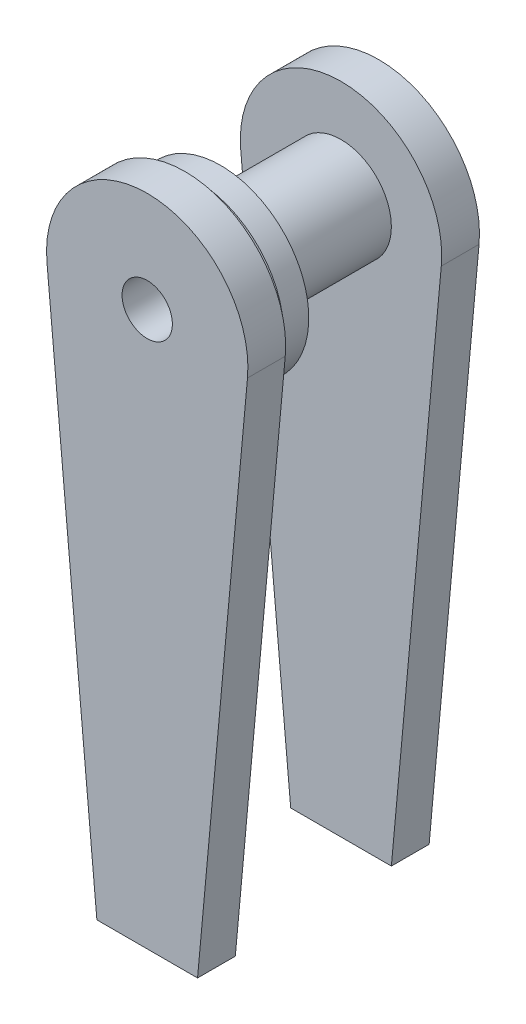
ISO-10303-21;
HEADER;
FILE_DESCRIPTION(('STEP AP214'),'2;1');
FILE_NAME('part.step','',(''),(''),'','','');
FILE_SCHEMA(('AUTOMOTIVE_DESIGN { 1 0 10303 214 1 1 1 1 }'));
ENDSEC;
DATA;
#1=APPLICATION_CONTEXT('core data for automotive mechanical design processes');
#2=APPLICATION_PROTOCOL_DEFINITION('international standard','automotive_design',2000,#1);
#3=PRODUCT_CONTEXT('',#1,'mechanical');
#4=PRODUCT('Part','Part','',(#3));
#5=PRODUCT_RELATED_PRODUCT_CATEGORY('part','',(#4));
#6=PRODUCT_DEFINITION_FORMATION('','',#4);
#7=PRODUCT_DEFINITION_CONTEXT('part definition',#1,'design');
#8=PRODUCT_DEFINITION('design','',#6,#7);
#9=PRODUCT_DEFINITION_SHAPE('','',#8);
#10=(LENGTH_UNIT() NAMED_UNIT(*) SI_UNIT(.MILLI.,.METRE.));
#11=(NAMED_UNIT(*) PLANE_ANGLE_UNIT() SI_UNIT($,.RADIAN.));
#12=(NAMED_UNIT(*) SI_UNIT($,.STERADIAN.) SOLID_ANGLE_UNIT());
#13=UNCERTAINTY_MEASURE_WITH_UNIT(LENGTH_MEASURE(1.E-05),#10,'distance_accuracy_value','');
#14=(GEOMETRIC_REPRESENTATION_CONTEXT(3) GLOBAL_UNCERTAINTY_ASSIGNED_CONTEXT((#13)) GLOBAL_UNIT_ASSIGNED_CONTEXT((#10,
#11,#12)) REPRESENTATION_CONTEXT('',''));
#15=CARTESIAN_POINT('',(0.,0.,0.));
#16=DIRECTION('',(0.,0.,1.));
#17=DIRECTION('',(1.,0.,0.));
#18=AXIS2_PLACEMENT_3D('',#15,#16,#17);
#19=CARTESIAN_POINT('',(0.,0.,48.895));
#20=DIRECTION('',(0.,0.,-1.));
#21=DIRECTION('',(-1.,0.,0.));
#22=AXIS2_PLACEMENT_3D('',#19,#20,#21);
#23=CYLINDRICAL_SURFACE('',#22,12.7);
#24=CARTESIAN_POINT('',(0.,0.,48.895));
#25=DIRECTION('',(0.,0.,1.));
#26=DIRECTION('',(1.,0.,0.));
#27=AXIS2_PLACEMENT_3D('',#24,#25,#26);
#28=CIRCLE('',#27,12.7);
#29=CARTESIAN_POINT('',(12.7,0.,48.895));
#30=VERTEX_POINT('',#29);
#31=EDGE_CURVE('E175',#30,#30,#28,.T.);
#32=ORIENTED_EDGE('',*,*,#31,.F.);
#33=EDGE_LOOP('',(#32));
#34=FACE_BOUND('',#33,.T.);
#35=CARTESIAN_POINT('',(0.,0.,46.228));
#36=DIRECTION('',(0.,0.,-1.));
#37=DIRECTION('',(-1.,0.,0.));
#38=AXIS2_PLACEMENT_3D('',#35,#36,#37);
#39=CIRCLE('',#38,12.7);
#40=CARTESIAN_POINT('',(-12.7,0.,46.228));
#41=VERTEX_POINT('',#40);
#42=EDGE_CURVE('E11',#41,#41,#39,.T.);
#43=ORIENTED_EDGE('',*,*,#42,.F.);
#44=EDGE_LOOP('',(#43));
#45=FACE_BOUND('',#44,.T.);
#46=ADVANCED_FACE('F39',(#34,#45),#23,.T.);
#47=CARTESIAN_POINT('',(0.,0.,9.525));
#48=DIRECTION('',(0.,0.,1.));
#49=DIRECTION('',(1.,0.,0.));
#50=AXIS2_PLACEMENT_3D('',#47,#48,#49);
#51=PLANE('',#50);
#52=DIRECTION('',(-0.0912886844983583,-0.995824470518052,0.));
#53=VECTOR('',#52,1.);
#54=CARTESIAN_POINT('',(25.2939415511585,-2.3187325862583,9.525));
#55=LINE('',#54,#53);
#56=CARTESIAN_POINT('',(25.2939415511585,-2.3187325862583,9.525));
#57=VERTEX_POINT('',#56);
#58=CARTESIAN_POINT('',(12.7000000000001,-139.7,9.525));
#59=VERTEX_POINT('',#58);
#60=EDGE_CURVE('E183',#57,#59,#55,.T.);
#61=ORIENTED_EDGE('',*,*,#60,.F.);
#62=CARTESIAN_POINT('',(0.,0.,9.525));
#63=DIRECTION('',(0.,0.,1.));
#64=DIRECTION('',(1.,0.,0.));
#65=AXIS2_PLACEMENT_3D('',#62,#63,#64);
#66=CIRCLE('',#65,25.4);
#67=CARTESIAN_POINT('',(-25.2939415511585,-2.31873258625833,9.525));
#68=VERTEX_POINT('',#67);
#69=EDGE_CURVE('E186',#57,#68,#66,.T.);
#70=ORIENTED_EDGE('',*,*,#69,.T.);
#71=DIRECTION('',(0.0912886844983595,-0.995824470518052,0.));
#72=VECTOR('',#71,1.);
#73=CARTESIAN_POINT('',(-25.2939415511585,-2.31873258625833,9.525));
#74=LINE('',#73,#72);
#75=CARTESIAN_POINT('',(-12.6999999999999,-139.7,9.525));
#76=VERTEX_POINT('',#75);
#77=EDGE_CURVE('E190',#68,#76,#74,.T.);
#78=ORIENTED_EDGE('',*,*,#77,.T.);
#79=DIRECTION('',(1.,0.,0.));
#80=VECTOR('',#79,1.);
#81=CARTESIAN_POINT('',(0.,-139.7,9.525));
#82=LINE('',#81,#80);
#83=EDGE_CURVE('E57',#76,#59,#82,.T.);
#84=ORIENTED_EDGE('',*,*,#83,.T.);
#85=EDGE_LOOP('',(#61,#70,#78,#84));
#86=FACE_BOUND('',#85,.T.);
#87=CARTESIAN_POINT('',(0.,0.,9.525));
#88=DIRECTION('',(0.,0.,1.));
#89=DIRECTION('',(1.,0.,0.));
#90=AXIS2_PLACEMENT_3D('',#87,#88,#89);
#91=CIRCLE('',#90,12.7);
#92=CARTESIAN_POINT('',(12.7,0.,9.525));
#93=VERTEX_POINT('',#92);
#94=EDGE_CURVE('E137',#93,#93,#91,.T.);
#95=ORIENTED_EDGE('',*,*,#94,.F.);
#96=EDGE_LOOP('',(#95));
#97=FACE_BOUND('',#96,.T.);
#98=ADVANCED_FACE('F226',(#86,#97),#51,.T.);
#99=CARTESIAN_POINT('',(25.2939415511585,-2.3187325862583,9.525));
#100=DIRECTION('',(0.995824470518052,-0.0912886844983583,0.));
#101=DIRECTION('',(0.0912886844983583,0.995824470518052,0.));
#102=AXIS2_PLACEMENT_3D('',#99,#100,#101);
#103=PLANE('',#102);
#104=DIRECTION('',(-0.0912886844983583,-0.995824470518052,0.));
#105=VECTOR('',#104,1.);
#106=CARTESIAN_POINT('',(25.2939415511585,-2.3187325862583,0.));
#107=LINE('',#106,#105);
#108=CARTESIAN_POINT('',(25.2939415511585,-2.3187325862583,0.));
#109=VERTEX_POINT('',#108);
#110=CARTESIAN_POINT('',(12.7000000000001,-139.7,0.));
#111=VERTEX_POINT('',#110);
#112=EDGE_CURVE('E179',#109,#111,#107,.T.);
#113=ORIENTED_EDGE('',*,*,#112,.F.);
#114=DIRECTION('',(0.,0.,-1.));
#115=VECTOR('',#114,1.);
#116=CARTESIAN_POINT('',(25.2939415511585,-2.3187325862583,9.525));
#117=LINE('',#116,#115);
#118=EDGE_CURVE('E49',#57,#109,#117,.T.);
#119=ORIENTED_EDGE('',*,*,#118,.F.);
#120=ORIENTED_EDGE('',*,*,#60,.T.);
#121=DIRECTION('',(0.,0.,-1.));
#122=VECTOR('',#121,1.);
#123=CARTESIAN_POINT('',(12.7000000000001,-139.7,9.525));
#124=LINE('',#123,#122);
#125=EDGE_CURVE('E82',#59,#111,#124,.T.);
#126=ORIENTED_EDGE('',*,*,#125,.T.);
#127=EDGE_LOOP('',(#113,#119,#120,#126));
#128=FACE_BOUND('',#127,.T.);
#129=ADVANCED_FACE('F41',(#128),#103,.T.);
#130=CARTESIAN_POINT('',(0.,0.,9.525));
#131=DIRECTION('',(0.,0.,-1.));
#132=DIRECTION('',(-1.,0.,0.));
#133=AXIS2_PLACEMENT_3D('',#130,#131,#132);
#134=CYLINDRICAL_SURFACE('',#133,25.4);
#135=CARTESIAN_POINT('',(0.,0.,0.));
#136=DIRECTION('',(0.,0.,1.));
#137=DIRECTION('',(1.,0.,0.));
#138=AXIS2_PLACEMENT_3D('',#135,#136,#137);
#139=CIRCLE('',#138,25.4);
#140=CARTESIAN_POINT('',(-25.2939415511585,-2.31873258625833,0.));
#141=VERTEX_POINT('',#140);
#142=EDGE_CURVE('E198',#109,#141,#139,.T.);
#143=ORIENTED_EDGE('',*,*,#142,.T.);
#144=DIRECTION('',(0.,0.,-1.));
#145=VECTOR('',#144,1.);
#146=CARTESIAN_POINT('',(-25.2939415511585,-2.31873258625833,9.525));
#147=LINE('',#146,#145);
#148=EDGE_CURVE('E214',#68,#141,#147,.T.);
#149=ORIENTED_EDGE('',*,*,#148,.F.);
#150=ORIENTED_EDGE('',*,*,#69,.F.);
#151=ORIENTED_EDGE('',*,*,#118,.T.);
#152=EDGE_LOOP('',(#143,#149,#150,#151));
#153=FACE_BOUND('',#152,.T.);
#154=ADVANCED_FACE('F219',(#153),#134,.T.);
#155=CARTESIAN_POINT('',(-25.2939415511585,-2.31873258625833,9.525));
#156=DIRECTION('',(0.995824470518052,0.0912886844983595,0.));
#157=DIRECTION('',(-0.0912886844983595,0.995824470518052,0.));
#158=AXIS2_PLACEMENT_3D('',#155,#156,#157);
#159=PLANE('',#158);
#160=DIRECTION('',(0.0912886844983595,-0.995824470518052,0.));
#161=VECTOR('',#160,1.);
#162=CARTESIAN_POINT('',(-25.2939415511585,-2.31873258625833,0.));
#163=LINE('',#162,#161);
#164=CARTESIAN_POINT('',(-12.6999999999999,-139.7,0.));
#165=VERTEX_POINT('',#164);
#166=EDGE_CURVE('E75',#141,#165,#163,.T.);
#167=ORIENTED_EDGE('',*,*,#166,.T.);
#168=DIRECTION('',(0.,0.,-1.));
#169=VECTOR('',#168,1.);
#170=CARTESIAN_POINT('',(-12.6999999999999,-139.7,9.525));
#171=LINE('',#170,#169);
#172=EDGE_CURVE('E211',#76,#165,#171,.T.);
#173=ORIENTED_EDGE('',*,*,#172,.F.);
#174=ORIENTED_EDGE('',*,*,#77,.F.);
#175=ORIENTED_EDGE('',*,*,#148,.T.);
#176=EDGE_LOOP('',(#167,#173,#174,#175));
#177=FACE_BOUND('',#176,.T.);
#178=ADVANCED_FACE('F231',(#177),#159,.F.);
#179=CARTESIAN_POINT('',(0.,-139.7,9.525));
#180=DIRECTION('',(0.,1.,0.));
#181=DIRECTION('',(0.,0.,1.));
#182=AXIS2_PLACEMENT_3D('',#179,#180,#181);
#183=PLANE('',#182);
#184=DIRECTION('',(1.,0.,0.));
#185=VECTOR('',#184,1.);
#186=CARTESIAN_POINT('',(0.,-139.7,0.));
#187=LINE('',#186,#185);
#188=EDGE_CURVE('E203',#165,#111,#187,.T.);
#189=ORIENTED_EDGE('',*,*,#188,.T.);
#190=ORIENTED_EDGE('',*,*,#125,.F.);
#191=ORIENTED_EDGE('',*,*,#83,.F.);
#192=ORIENTED_EDGE('',*,*,#172,.T.);
#193=EDGE_LOOP('',(#189,#190,#191,#192));
#194=FACE_BOUND('',#193,.T.);
#195=ADVANCED_FACE('F370',(#194),#183,.F.);
#196=CARTESIAN_POINT('',(0.,0.,9.525));
#197=DIRECTION('',(0.,0.,-1.));
#198=DIRECTION('',(-1.,0.,0.));
#199=AXIS2_PLACEMENT_3D('',#196,#197,#198);
#200=CYLINDRICAL_SURFACE('',#199,6.35);
#201=CARTESIAN_POINT('',(0.,0.,0.));
#202=DIRECTION('',(0.,0.,1.));
#203=DIRECTION('',(1.,0.,0.));
#204=AXIS2_PLACEMENT_3D('',#201,#202,#203);
#205=CIRCLE('',#204,6.35);
#206=CARTESIAN_POINT('',(6.35,0.,0.));
#207=VERTEX_POINT('',#206);
#208=EDGE_CURVE('E187',#207,#207,#205,.T.);
#209=ORIENTED_EDGE('',*,*,#208,.F.);
#210=EDGE_LOOP('',(#209));
#211=FACE_BOUND('',#210,.T.);
#212=CARTESIAN_POINT('',(0.,0.,58.42));
#213=DIRECTION('',(0.,0.,1.));
#214=DIRECTION('',(1.,0.,0.));
#215=AXIS2_PLACEMENT_3D('',#212,#213,#214);
#216=CIRCLE('',#215,6.35);
#217=CARTESIAN_POINT('',(6.35,0.,58.42));
#218=VERTEX_POINT('',#217);
#219=EDGE_CURVE('E126',#218,#218,#216,.T.);
#220=ORIENTED_EDGE('',*,*,#219,.T.);
#221=EDGE_LOOP('',(#220));
#222=FACE_BOUND('',#221,.T.);
#223=ADVANCED_FACE('F248',(#211,#222),#200,.F.);
#224=CARTESIAN_POINT('',(0.,0.,0.));
#225=DIRECTION('',(0.,0.,1.));
#226=DIRECTION('',(1.,0.,0.));
#227=AXIS2_PLACEMENT_3D('',#224,#225,#226);
#228=PLANE('',#227);
#229=ORIENTED_EDGE('',*,*,#112,.T.);
#230=ORIENTED_EDGE('',*,*,#188,.F.);
#231=ORIENTED_EDGE('',*,*,#166,.F.);
#232=ORIENTED_EDGE('',*,*,#142,.F.);
#233=EDGE_LOOP('',(#229,#230,#231,#232));
#234=FACE_BOUND('',#233,.T.);
#235=ORIENTED_EDGE('',*,*,#208,.T.);
#236=EDGE_LOOP('',(#235));
#237=FACE_BOUND('',#236,.T.);
#238=ADVANCED_FACE('F222',(#234,#237),#228,.F.);
#239=CARTESIAN_POINT('',(0.,0.,39.878));
#240=DIRECTION('',(0.,0.,-1.));
#241=DIRECTION('',(-1.,0.,0.));
#242=AXIS2_PLACEMENT_3D('',#239,#240,#241);
#243=CIRCLE('',#242,12.7);
#244=CARTESIAN_POINT('',(-12.7,0.,39.878));
#245=VERTEX_POINT('',#244);
#246=EDGE_CURVE('E253',#245,#245,#243,.T.);
#247=ORIENTED_EDGE('',*,*,#246,.T.);
#248=EDGE_LOOP('',(#247));
#249=FACE_BOUND('',#248,.T.);
#250=ORIENTED_EDGE('',*,*,#94,.T.);
#251=EDGE_LOOP('',(#250));
#252=FACE_BOUND('',#251,.T.);
#253=ADVANCED_FACE('F236',(#249,#252),#23,.T.);
#254=CARTESIAN_POINT('',(25.2939415511585,-2.3187325862583,48.895));
#255=DIRECTION('',(-0.995824470518052,0.0912886844983583,0.));
#256=DIRECTION('',(-0.0912886844983583,-0.995824470518052,0.));
#257=AXIS2_PLACEMENT_3D('',#254,#255,#256);
#258=PLANE('',#257);
#259=DIRECTION('',(-0.0912886844983583,-0.995824470518052,0.));
#260=VECTOR('',#259,1.);
#261=CARTESIAN_POINT('',(25.2939415511585,-2.3187325862583,58.42));
#262=LINE('',#261,#260);
#263=CARTESIAN_POINT('',(25.2939415511585,-2.3187325862583,58.42));
#264=VERTEX_POINT('',#263);
#265=CARTESIAN_POINT('',(12.7000000000001,-139.7,58.42));
#266=VERTEX_POINT('',#265);
#267=EDGE_CURVE('E132',#264,#266,#262,.T.);
#268=ORIENTED_EDGE('',*,*,#267,.T.);
#269=DIRECTION('',(0.,0.,1.));
#270=VECTOR('',#269,1.);
#271=CARTESIAN_POINT('',(12.7000000000001,-139.7,48.895));
#272=LINE('',#271,#270);
#273=CARTESIAN_POINT('',(12.7000000000001,-139.7,48.895));
#274=VERTEX_POINT('',#273);
#275=EDGE_CURVE('E129',#274,#266,#272,.T.);
#276=ORIENTED_EDGE('',*,*,#275,.F.);
#277=DIRECTION('',(-0.0912886844983583,-0.995824470518052,0.));
#278=VECTOR('',#277,1.);
#279=CARTESIAN_POINT('',(25.2939415511585,-2.3187325862583,48.895));
#280=LINE('',#279,#278);
#281=CARTESIAN_POINT('',(25.2939415511585,-2.3187325862583,48.895));
#282=VERTEX_POINT('',#281);
#283=EDGE_CURVE('E115',#282,#274,#280,.T.);
#284=ORIENTED_EDGE('',*,*,#283,.F.);
#285=DIRECTION('',(0.,0.,1.));
#286=VECTOR('',#285,1.);
#287=CARTESIAN_POINT('',(25.2939415511585,-2.3187325862583,48.895));
#288=LINE('',#287,#286);
#289=EDGE_CURVE('E150',#282,#264,#288,.T.);
#290=ORIENTED_EDGE('',*,*,#289,.T.);
#291=EDGE_LOOP('',(#268,#276,#284,#290));
#292=FACE_BOUND('',#291,.T.);
#293=ADVANCED_FACE('F130',(#292),#258,.F.);
#294=CARTESIAN_POINT('',(0.,-139.7,48.895));
#295=DIRECTION('',(0.,-1.,0.));
#296=DIRECTION('',(0.,0.,-1.));
#297=AXIS2_PLACEMENT_3D('',#294,#295,#296);
#298=PLANE('',#297);
#299=DIRECTION('',(1.,0.,0.));
#300=VECTOR('',#299,1.);
#301=CARTESIAN_POINT('',(0.,-139.7,58.42));
#302=LINE('',#301,#300);
#303=CARTESIAN_POINT('',(-12.6999999999999,-139.7,58.42));
#304=VERTEX_POINT('',#303);
#305=EDGE_CURVE('E153',#304,#266,#302,.T.);
#306=ORIENTED_EDGE('',*,*,#305,.F.);
#307=DIRECTION('',(0.,0.,1.));
#308=VECTOR('',#307,1.);
#309=CARTESIAN_POINT('',(-12.6999999999999,-139.7,48.895));
#310=LINE('',#309,#308);
#311=CARTESIAN_POINT('',(-12.6999999999999,-139.7,48.895));
#312=VERTEX_POINT('',#311);
#313=EDGE_CURVE('E138',#312,#304,#310,.T.);
#314=ORIENTED_EDGE('',*,*,#313,.F.);
#315=DIRECTION('',(1.,0.,0.));
#316=VECTOR('',#315,1.);
#317=CARTESIAN_POINT('',(0.,-139.7,48.895));
#318=LINE('',#317,#316);
#319=EDGE_CURVE('E120',#312,#274,#318,.T.);
#320=ORIENTED_EDGE('',*,*,#319,.T.);
#321=ORIENTED_EDGE('',*,*,#275,.T.);
#322=EDGE_LOOP('',(#306,#314,#320,#321));
#323=FACE_BOUND('',#322,.T.);
#324=ADVANCED_FACE('F140',(#323),#298,.T.);
#325=CARTESIAN_POINT('',(-25.2939415511585,-2.31873258625833,48.895));
#326=DIRECTION('',(-0.995824470518052,-0.0912886844983595,0.));
#327=DIRECTION('',(0.0912886844983595,-0.995824470518052,0.));
#328=AXIS2_PLACEMENT_3D('',#325,#326,#327);
#329=PLANE('',#328);
#330=DIRECTION('',(0.0912886844983595,-0.995824470518052,0.));
#331=VECTOR('',#330,1.);
#332=CARTESIAN_POINT('',(-25.2939415511585,-2.31873258625833,58.42));
#333=LINE('',#332,#331);
#334=CARTESIAN_POINT('',(-25.2939415511585,-2.31873258625833,58.42));
#335=VERTEX_POINT('',#334);
#336=EDGE_CURVE('E157',#335,#304,#333,.T.);
#337=ORIENTED_EDGE('',*,*,#336,.F.);
#338=DIRECTION('',(0.,0.,1.));
#339=VECTOR('',#338,1.);
#340=CARTESIAN_POINT('',(-25.2939415511585,-2.31873258625833,48.895));
#341=LINE('',#340,#339);
#342=CARTESIAN_POINT('',(-25.2939415511585,-2.31873258625833,48.895));
#343=VERTEX_POINT('',#342);
#344=EDGE_CURVE('E170',#343,#335,#341,.T.);
#345=ORIENTED_EDGE('',*,*,#344,.F.);
#346=DIRECTION('',(0.0912886844983595,-0.995824470518052,0.));
#347=VECTOR('',#346,1.);
#348=CARTESIAN_POINT('',(-25.2939415511585,-2.31873258625833,48.895));
#349=LINE('',#348,#347);
#350=EDGE_CURVE('E142',#343,#312,#349,.T.);
#351=ORIENTED_EDGE('',*,*,#350,.T.);
#352=ORIENTED_EDGE('',*,*,#313,.T.);
#353=EDGE_LOOP('',(#337,#345,#351,#352));
#354=FACE_BOUND('',#353,.T.);
#355=ADVANCED_FACE('F292',(#354),#329,.T.);
#356=CARTESIAN_POINT('',(0.,0.,48.895));
#357=DIRECTION('',(0.,0.,1.));
#358=DIRECTION('',(1.,0.,0.));
#359=AXIS2_PLACEMENT_3D('',#356,#357,#358);
#360=CYLINDRICAL_SURFACE('',#359,25.4);
#361=CARTESIAN_POINT('',(0.,0.,58.42));
#362=DIRECTION('',(0.,0.,1.));
#363=DIRECTION('',(1.,0.,0.));
#364=AXIS2_PLACEMENT_3D('',#361,#362,#363);
#365=CIRCLE('',#364,25.4);
#366=EDGE_CURVE('E161',#264,#335,#365,.T.);
#367=ORIENTED_EDGE('',*,*,#366,.F.);
#368=ORIENTED_EDGE('',*,*,#289,.F.);
#369=CARTESIAN_POINT('',(0.,0.,48.895));
#370=DIRECTION('',(0.,0.,1.));
#371=DIRECTION('',(1.,0.,0.));
#372=AXIS2_PLACEMENT_3D('',#369,#370,#371);
#373=CIRCLE('',#372,25.4);
#374=EDGE_CURVE('E123',#282,#343,#373,.T.);
#375=ORIENTED_EDGE('',*,*,#374,.T.);
#376=ORIENTED_EDGE('',*,*,#344,.T.);
#377=EDGE_LOOP('',(#367,#368,#375,#376));
#378=FACE_BOUND('',#377,.T.);
#379=ADVANCED_FACE('F285',(#378),#360,.T.);
#380=CARTESIAN_POINT('',(0.,0.,48.895));
#381=DIRECTION('',(0.,0.,-1.));
#382=DIRECTION('',(1.,0.,0.));
#383=AXIS2_PLACEMENT_3D('',#380,#381,#382);
#384=PLANE('',#383);
#385=ORIENTED_EDGE('',*,*,#31,.T.);
#386=EDGE_LOOP('',(#385));
#387=FACE_BOUND('',#386,.T.);
#388=ORIENTED_EDGE('',*,*,#283,.T.);
#389=ORIENTED_EDGE('',*,*,#319,.F.);
#390=ORIENTED_EDGE('',*,*,#350,.F.);
#391=ORIENTED_EDGE('',*,*,#374,.F.);
#392=EDGE_LOOP('',(#388,#389,#390,#391));
#393=FACE_BOUND('',#392,.T.);
#394=ADVANCED_FACE('F117',(#387,#393),#384,.T.);
#395=CARTESIAN_POINT('',(0.,0.,58.42));
#396=DIRECTION('',(0.,0.,-1.));
#397=DIRECTION('',(1.,0.,0.));
#398=AXIS2_PLACEMENT_3D('',#395,#396,#397);
#399=PLANE('',#398);
#400=ORIENTED_EDGE('',*,*,#267,.F.);
#401=ORIENTED_EDGE('',*,*,#366,.T.);
#402=ORIENTED_EDGE('',*,*,#336,.T.);
#403=ORIENTED_EDGE('',*,*,#305,.T.);
#404=EDGE_LOOP('',(#400,#401,#402,#403));
#405=FACE_BOUND('',#404,.T.);
#406=ORIENTED_EDGE('',*,*,#219,.F.);
#407=EDGE_LOOP('',(#406));
#408=FACE_BOUND('',#407,.T.);
#409=ADVANCED_FACE('F280',(#405,#408),#399,.F.);
#410=CARTESIAN_POINT('',(0.,0.,46.228));
#411=DIRECTION('',(0.,0.,-1.));
#412=DIRECTION('',(-1.,0.,0.));
#413=AXIS2_PLACEMENT_3D('',#410,#411,#412);
#414=CYLINDRICAL_SURFACE('',#413,22.225);
#415=CARTESIAN_POINT('',(0.,0.,46.228));
#416=DIRECTION('',(0.,0.,-1.));
#417=DIRECTION('',(-1.,0.,0.));
#418=AXIS2_PLACEMENT_3D('',#415,#416,#417);
#419=CIRCLE('',#418,22.225);
#420=CARTESIAN_POINT('',(-22.225,0.,46.228));
#421=VERTEX_POINT('',#420);
#422=EDGE_CURVE('E154',#421,#421,#419,.T.);
#423=ORIENTED_EDGE('',*,*,#422,.T.);
#424=EDGE_LOOP('',(#423));
#425=FACE_BOUND('',#424,.T.);
#426=CARTESIAN_POINT('',(0.,0.,39.878));
#427=DIRECTION('',(0.,0.,-1.));
#428=DIRECTION('',(-1.,0.,0.));
#429=AXIS2_PLACEMENT_3D('',#426,#427,#428);
#430=CIRCLE('',#429,22.225);
#431=CARTESIAN_POINT('',(-22.225,0.,39.878));
#432=VERTEX_POINT('',#431);
#433=EDGE_CURVE('E258',#432,#432,#430,.T.);
#434=ORIENTED_EDGE('',*,*,#433,.F.);
#435=EDGE_LOOP('',(#434));
#436=FACE_BOUND('',#435,.T.);
#437=ADVANCED_FACE('F267',(#425,#436),#414,.T.);
#438=CARTESIAN_POINT('',(0.,0.,46.228));
#439=DIRECTION('',(0.,0.,-1.));
#440=DIRECTION('',(-1.,0.,0.));
#441=AXIS2_PLACEMENT_3D('',#438,#439,#440);
#442=PLANE('',#441);
#443=ORIENTED_EDGE('',*,*,#42,.T.);
#444=EDGE_LOOP('',(#443));
#445=FACE_BOUND('',#444,.T.);
#446=ORIENTED_EDGE('',*,*,#422,.F.);
#447=EDGE_LOOP('',(#446));
#448=FACE_BOUND('',#447,.T.);
#449=ADVANCED_FACE('F270',(#445,#448),#442,.F.);
#450=CARTESIAN_POINT('',(0.,0.,39.878));
#451=DIRECTION('',(0.,0.,-1.));
#452=DIRECTION('',(-1.,0.,0.));
#453=AXIS2_PLACEMENT_3D('',#450,#451,#452);
#454=PLANE('',#453);
#455=ORIENTED_EDGE('',*,*,#246,.F.);
#456=EDGE_LOOP('',(#455));
#457=FACE_BOUND('',#456,.T.);
#458=ORIENTED_EDGE('',*,*,#433,.T.);
#459=EDGE_LOOP('',(#458));
#460=FACE_BOUND('',#459,.T.);
#461=ADVANCED_FACE('F272',(#457,#460),#454,.T.);
#462=CLOSED_SHELL('',(#46,#98,#129,#154,#178,#195,#223,#238,#253,#293,#324,#355,#379,#394,#409,
#437,#449,#461));
#463=MANIFOLD_SOLID_BREP('B2',#462);
#464=ADVANCED_BREP_SHAPE_REPRESENTATION('',(#18,#463),#14);
#465=SHAPE_DEFINITION_REPRESENTATION(#9,#464);
ENDSEC;
END-ISO-10303-21;
